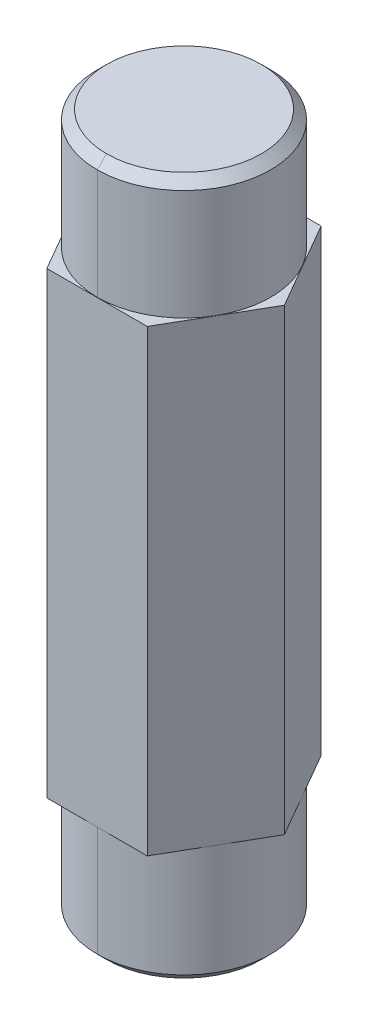
ISO-10303-21;
HEADER;
FILE_DESCRIPTION(('STEP AP214'),'2;1');
FILE_NAME('part.step','',(''),(''),'','','');
FILE_SCHEMA(('AUTOMOTIVE_DESIGN { 1 0 10303 214 1 1 1 1 }'));
ENDSEC;
DATA;
#1=APPLICATION_CONTEXT('core data for automotive mechanical design processes');
#2=APPLICATION_PROTOCOL_DEFINITION('international standard','automotive_design',2000,#1);
#3=PRODUCT_CONTEXT('',#1,'mechanical');
#4=PRODUCT('Part','Part','',(#3));
#5=PRODUCT_RELATED_PRODUCT_CATEGORY('part','',(#4));
#6=PRODUCT_DEFINITION_FORMATION('','',#4);
#7=PRODUCT_DEFINITION_CONTEXT('part definition',#1,'design');
#8=PRODUCT_DEFINITION('design','',#6,#7);
#9=PRODUCT_DEFINITION_SHAPE('','',#8);
#10=(LENGTH_UNIT() NAMED_UNIT(*) SI_UNIT(.MILLI.,.METRE.));
#11=(NAMED_UNIT(*) PLANE_ANGLE_UNIT() SI_UNIT($,.RADIAN.));
#12=(NAMED_UNIT(*) SI_UNIT($,.STERADIAN.) SOLID_ANGLE_UNIT());
#13=UNCERTAINTY_MEASURE_WITH_UNIT(LENGTH_MEASURE(1.E-05),#10,'distance_accuracy_value','');
#14=(GEOMETRIC_REPRESENTATION_CONTEXT(3) GLOBAL_UNCERTAINTY_ASSIGNED_CONTEXT((#13)) GLOBAL_UNIT_ASSIGNED_CONTEXT((#10,
#11,#12)) REPRESENTATION_CONTEXT('',''));
#15=CARTESIAN_POINT('',(0.,0.,0.));
#16=DIRECTION('',(0.,0.,1.));
#17=DIRECTION('',(1.,0.,0.));
#18=AXIS2_PLACEMENT_3D('',#15,#16,#17);
#19=CARTESIAN_POINT('',(-39.2241243202131,6.35,-16.6661167863654));
#20=DIRECTION('',(0.,-1.,0.));
#21=DIRECTION('',(0.,0.,-1.));
#22=AXIS2_PLACEMENT_3D('',#19,#20,#21);
#23=CYLINDRICAL_SURFACE('',#22,4.7498);
#24=DIRECTION('',(0.,-1.,0.));
#25=VECTOR('',#24,1.);
#26=CARTESIAN_POINT('',(-39.2241243202131,6.35,-11.9163167863655));
#27=LINE('',#26,#25);
#28=CARTESIAN_POINT('',(-39.2241243202131,5.842,-11.9163167863655));
#29=VERTEX_POINT('',#28);
#30=CARTESIAN_POINT('',(-39.2241243202131,-0.2032,-11.9163167863655));
#31=VERTEX_POINT('',#30);
#32=EDGE_CURVE('E296',#29,#31,#27,.T.);
#33=ORIENTED_EDGE('',*,*,#32,.F.);
#34=CARTESIAN_POINT('',(-39.2241243202131,5.842,-16.6661167863654));
#35=DIRECTION('',(0.,-1.,0.));
#36=DIRECTION('',(0.,0.,-1.));
#37=AXIS2_PLACEMENT_3D('',#34,#35,#36);
#38=CIRCLE('',#37,4.7498);
#39=CARTESIAN_POINT('',(-39.2241243202131,5.842,-21.4159167863655));
#40=VERTEX_POINT('',#39);
#41=EDGE_CURVE('E11',#29,#40,#38,.T.);
#42=ORIENTED_EDGE('',*,*,#41,.T.);
#43=DIRECTION('',(0.,-1.,0.));
#44=VECTOR('',#43,1.);
#45=CARTESIAN_POINT('',(-39.2241243202131,6.35,-21.4159167863655));
#46=LINE('',#45,#44);
#47=CARTESIAN_POINT('',(-39.2241243202131,-0.2032,-21.4159167863655));
#48=VERTEX_POINT('',#47);
#49=EDGE_CURVE('E192',#40,#48,#46,.T.);
#50=ORIENTED_EDGE('',*,*,#49,.T.);
#51=CARTESIAN_POINT('',(-39.2241243202131,-0.2032,-16.6661167863654));
#52=DIRECTION('',(0.,1.,0.));
#53=DIRECTION('',(0.,0.,1.));
#54=AXIS2_PLACEMENT_3D('',#51,#52,#53);
#55=CIRCLE('',#54,4.7498);
#56=EDGE_CURVE('E147',#48,#31,#55,.T.);
#57=ORIENTED_EDGE('',*,*,#56,.T.);
#58=EDGE_LOOP('',(#33,#42,#50,#57));
#59=FACE_BOUND('',#58,.T.);
#60=ADVANCED_FACE('F16',(#59),#23,.T.);
#61=CARTESIAN_POINT('',(-39.2241243202131,5.842,-16.6661167863654));
#62=DIRECTION('',(0.,-1.,0.));
#63=DIRECTION('',(0.,0.,-1.));
#64=AXIS2_PLACEMENT_3D('',#61,#62,#63);
#65=CONICAL_SURFACE('',#64,4.7498,0.785398163397452);
#66=DIRECTION('',(0.,-0.707106781186545,0.70710678118655));
#67=VECTOR('',#66,1.);
#68=CARTESIAN_POINT('',(-39.2241243202131,5.842,-11.9163167863655));
#69=LINE('',#68,#67);
#70=CARTESIAN_POINT('',(-39.2241243202131,6.35,-12.4243167863655));
#71=VERTEX_POINT('',#70);
#72=EDGE_CURVE('E181',#71,#29,#69,.T.);
#73=ORIENTED_EDGE('',*,*,#72,.F.);
#74=CARTESIAN_POINT('',(-39.2241243202131,6.35,-16.6661167863654));
#75=DIRECTION('',(0.,1.,0.));
#76=DIRECTION('',(0.,0.,-1.));
#77=AXIS2_PLACEMENT_3D('',#74,#75,#76);
#78=CIRCLE('',#77,4.2418);
#79=CARTESIAN_POINT('',(-39.2241243202131,6.35,-20.9079167863655));
#80=VERTEX_POINT('',#79);
#81=EDGE_CURVE('E24',#80,#71,#78,.T.);
#82=ORIENTED_EDGE('',*,*,#81,.F.);
#83=DIRECTION('',(0.,-0.707106781186545,-0.70710678118655));
#84=VECTOR('',#83,1.);
#85=CARTESIAN_POINT('',(-39.2241243202131,5.842,-21.4159167863655));
#86=LINE('',#85,#84);
#87=EDGE_CURVE('E175',#80,#40,#86,.T.);
#88=ORIENTED_EDGE('',*,*,#87,.T.);
#89=ORIENTED_EDGE('',*,*,#41,.F.);
#90=EDGE_LOOP('',(#73,#82,#88,#89));
#91=FACE_BOUND('',#90,.T.);
#92=ADVANCED_FACE('F274',(#91),#65,.T.);
#93=CARTESIAN_POINT('',(-39.2241243202131,6.35,-16.6661167863654));
#94=DIRECTION('',(0.,-1.,0.));
#95=DIRECTION('',(0.,0.,-1.));
#96=AXIS2_PLACEMENT_3D('',#93,#94,#95);
#97=PLANE('',#96);
#98=ORIENTED_EDGE('',*,*,#81,.T.);
#99=CARTESIAN_POINT('',(-39.2241243202131,6.35,-16.6661167863654));
#100=DIRECTION('',(0.,1.,0.));
#101=DIRECTION('',(0.,0.,-1.));
#102=AXIS2_PLACEMENT_3D('',#99,#100,#101);
#103=CIRCLE('',#102,4.2418);
#104=EDGE_CURVE('E190',#71,#80,#103,.T.);
#105=ORIENTED_EDGE('',*,*,#104,.T.);
#106=EDGE_LOOP('',(#98,#105));
#107=FACE_BOUND('',#106,.T.);
#108=ADVANCED_FACE('F271',(#107),#97,.F.);
#109=CARTESIAN_POINT('',(-44.7233856342443,-0.2032,-16.6661167863654));
#110=DIRECTION('',(0.,1.,0.));
#111=DIRECTION('',(1.,0.,0.));
#112=AXIS2_PLACEMENT_3D('',#109,#110,#111);
#113=PLANE('',#112);
#114=ORIENTED_EDGE('',*,*,#56,.F.);
#115=CARTESIAN_POINT('',(-39.2241243202131,-0.2032,-16.6661167863654));
#116=DIRECTION('',(0.,1.,0.));
#117=DIRECTION('',(0.,0.,1.));
#118=AXIS2_PLACEMENT_3D('',#115,#116,#117);
#119=CIRCLE('',#118,4.7498);
#120=EDGE_CURVE('E286',#31,#48,#119,.T.);
#121=ORIENTED_EDGE('',*,*,#120,.F.);
#122=EDGE_LOOP('',(#114,#121));
#123=FACE_BOUND('',#122,.T.);
#124=DIRECTION('',(-0.5,0.,0.866025403784438));
#125=VECTOR('',#124,1.);
#126=CARTESIAN_POINT('',(-41.9737549772286,-0.2032,-21.4286167863654));
#127=LINE('',#126,#125);
#128=CARTESIAN_POINT('',(-41.9737549772286,-0.2032,-21.4286167863654));
#129=VERTEX_POINT('',#128);
#130=CARTESIAN_POINT('',(-44.7233856342443,-0.2032,-16.6661167863654));
#131=VERTEX_POINT('',#130);
#132=EDGE_CURVE('E40',#129,#131,#127,.T.);
#133=ORIENTED_EDGE('',*,*,#132,.T.);
#134=DIRECTION('',(0.5,0.,0.866025403784439));
#135=VECTOR('',#134,1.);
#136=CARTESIAN_POINT('',(-44.7233856342443,-0.2032,-16.6661167863654));
#137=LINE('',#136,#135);
#138=CARTESIAN_POINT('',(-41.9737549772286,-0.2032,-11.9036167863655));
#139=VERTEX_POINT('',#138);
#140=EDGE_CURVE('E214',#131,#139,#137,.T.);
#141=ORIENTED_EDGE('',*,*,#140,.T.);
#142=DIRECTION('',(1.,0.,0.));
#143=VECTOR('',#142,1.);
#144=CARTESIAN_POINT('',(-41.9737549772286,-0.2032,-11.9036167863655));
#145=LINE('',#144,#143);
#146=CARTESIAN_POINT('',(-36.4744936631975,-0.2032,-11.9036167863655));
#147=VERTEX_POINT('',#146);
#148=EDGE_CURVE('E226',#139,#147,#145,.T.);
#149=ORIENTED_EDGE('',*,*,#148,.T.);
#150=DIRECTION('',(0.5,0.,-0.866025403784438));
#151=VECTOR('',#150,1.);
#152=CARTESIAN_POINT('',(-36.4744936631975,-0.2032,-11.9036167863655));
#153=LINE('',#152,#151);
#154=CARTESIAN_POINT('',(-33.7248630061819,-0.2032,-16.6661167863654));
#155=VERTEX_POINT('',#154);
#156=EDGE_CURVE('E241',#147,#155,#153,.T.);
#157=ORIENTED_EDGE('',*,*,#156,.T.);
#158=DIRECTION('',(-0.5,0.,-0.866025403784439));
#159=VECTOR('',#158,1.);
#160=CARTESIAN_POINT('',(-33.7248630061819,-0.2032,-16.6661167863654));
#161=LINE('',#160,#159);
#162=CARTESIAN_POINT('',(-36.4744936631975,-0.2032,-21.4286167863654));
#163=VERTEX_POINT('',#162);
#164=EDGE_CURVE('E208',#155,#163,#161,.T.);
#165=ORIENTED_EDGE('',*,*,#164,.T.);
#166=DIRECTION('',(-1.,0.,0.));
#167=VECTOR('',#166,1.);
#168=CARTESIAN_POINT('',(-36.4744936631975,-0.2032,-21.4286167863654));
#169=LINE('',#168,#167);
#170=EDGE_CURVE('E251',#163,#129,#169,.T.);
#171=ORIENTED_EDGE('',*,*,#170,.T.);
#172=EDGE_LOOP('',(#133,#141,#149,#157,#165,#171));
#173=FACE_BOUND('',#172,.T.);
#174=ADVANCED_FACE('F568',(#123,#173),#113,.T.);
#175=CARTESIAN_POINT('',(-39.2241243202131,-31.877,-16.6661167863654));
#176=DIRECTION('',(0.,1.,0.));
#177=DIRECTION('',(0.,0.,1.));
#178=AXIS2_PLACEMENT_3D('',#175,#176,#177);
#179=CYLINDRICAL_SURFACE('',#178,4.7498);
#180=DIRECTION('',(0.,1.,0.));
#181=VECTOR('',#180,1.);
#182=CARTESIAN_POINT('',(-39.2241243202131,-31.877,-21.4159167863655));
#183=LINE('',#182,#181);
#184=CARTESIAN_POINT('',(-39.2241243202131,-31.369,-21.4159167863655));
#185=VERTEX_POINT('',#184);
#186=CARTESIAN_POINT('',(-39.2241243202131,-25.3238,-21.4159167863655));
#187=VERTEX_POINT('',#186);
#188=EDGE_CURVE('E162',#185,#187,#183,.T.);
#189=ORIENTED_EDGE('',*,*,#188,.F.);
#190=CARTESIAN_POINT('',(-39.2241243202131,-31.369,-16.6661167863654));
#191=DIRECTION('',(0.,1.,0.));
#192=DIRECTION('',(0.,0.,1.));
#193=AXIS2_PLACEMENT_3D('',#190,#191,#192);
#194=CIRCLE('',#193,4.7498);
#195=CARTESIAN_POINT('',(-39.2241243202131,-31.369,-11.9163167863655));
#196=VERTEX_POINT('',#195);
#197=EDGE_CURVE('E139',#185,#196,#194,.T.);
#198=ORIENTED_EDGE('',*,*,#197,.T.);
#199=DIRECTION('',(0.,1.,0.));
#200=VECTOR('',#199,1.);
#201=CARTESIAN_POINT('',(-39.2241243202131,-31.877,-11.9163167863655));
#202=LINE('',#201,#200);
#203=CARTESIAN_POINT('',(-39.2241243202131,-25.3238,-11.9163167863655));
#204=VERTEX_POINT('',#203);
#205=EDGE_CURVE('E174',#196,#204,#202,.T.);
#206=ORIENTED_EDGE('',*,*,#205,.T.);
#207=CARTESIAN_POINT('',(-39.2241243202131,-25.3238,-16.6661167863654));
#208=DIRECTION('',(0.,-1.,0.));
#209=DIRECTION('',(0.,0.,-1.));
#210=AXIS2_PLACEMENT_3D('',#207,#208,#209);
#211=CIRCLE('',#210,4.7498);
#212=EDGE_CURVE('E164',#204,#187,#211,.T.);
#213=ORIENTED_EDGE('',*,*,#212,.T.);
#214=EDGE_LOOP('',(#189,#198,#206,#213));
#215=FACE_BOUND('',#214,.T.);
#216=ADVANCED_FACE('F163',(#215),#179,.T.);
#217=CARTESIAN_POINT('',(-39.2241243202131,-31.369,-16.6661167863654));
#218=DIRECTION('',(0.,1.,0.));
#219=DIRECTION('',(0.,0.,1.));
#220=AXIS2_PLACEMENT_3D('',#217,#218,#219);
#221=CONICAL_SURFACE('',#220,4.7498,0.78539816339745);
#222=DIRECTION('',(0.,0.707106781186546,-0.707106781186549));
#223=VECTOR('',#222,1.);
#224=CARTESIAN_POINT('',(-39.2241243202131,-31.369,-21.4159167863655));
#225=LINE('',#224,#223);
#226=CARTESIAN_POINT('',(-39.2241243202131,-31.877,-20.9079167863655));
#227=VERTEX_POINT('',#226);
#228=EDGE_CURVE('E143',#227,#185,#225,.T.);
#229=ORIENTED_EDGE('',*,*,#228,.F.);
#230=CARTESIAN_POINT('',(-39.2241243202131,-31.877,-16.6661167863654));
#231=DIRECTION('',(0.,-1.,0.));
#232=DIRECTION('',(0.,0.,1.));
#233=AXIS2_PLACEMENT_3D('',#230,#231,#232);
#234=CIRCLE('',#233,4.2418);
#235=CARTESIAN_POINT('',(-39.2241243202131,-31.877,-12.4243167863655));
#236=VERTEX_POINT('',#235);
#237=EDGE_CURVE('E151',#236,#227,#234,.T.);
#238=ORIENTED_EDGE('',*,*,#237,.F.);
#239=DIRECTION('',(0.,0.707106781186546,0.707106781186549));
#240=VECTOR('',#239,1.);
#241=CARTESIAN_POINT('',(-39.2241243202131,-31.369,-11.9163167863655));
#242=LINE('',#241,#240);
#243=EDGE_CURVE('E145',#236,#196,#242,.T.);
#244=ORIENTED_EDGE('',*,*,#243,.T.);
#245=ORIENTED_EDGE('',*,*,#197,.F.);
#246=EDGE_LOOP('',(#229,#238,#244,#245));
#247=FACE_BOUND('',#246,.T.);
#248=ADVANCED_FACE('F138',(#247),#221,.T.);
#249=CARTESIAN_POINT('',(-39.2241243202131,-31.877,-16.6661167863654));
#250=DIRECTION('',(0.,1.,0.));
#251=DIRECTION('',(1.,0.,0.));
#252=AXIS2_PLACEMENT_3D('',#249,#250,#251);
#253=PLANE('',#252);
#254=ORIENTED_EDGE('',*,*,#237,.T.);
#255=CARTESIAN_POINT('',(-39.2241243202131,-31.877,-16.6661167863654));
#256=DIRECTION('',(0.,-1.,0.));
#257=DIRECTION('',(0.,0.,1.));
#258=AXIS2_PLACEMENT_3D('',#255,#256,#257);
#259=CIRCLE('',#258,4.2418);
#260=EDGE_CURVE('E157',#227,#236,#259,.T.);
#261=ORIENTED_EDGE('',*,*,#260,.T.);
#262=EDGE_LOOP('',(#254,#261));
#263=FACE_BOUND('',#262,.T.);
#264=ADVANCED_FACE('F610',(#263),#253,.F.);
#265=CARTESIAN_POINT('',(-41.9737549772286,-25.3238,-11.9036167863655));
#266=DIRECTION('',(0.,-1.,0.));
#267=DIRECTION('',(0.,0.,-1.));
#268=AXIS2_PLACEMENT_3D('',#265,#266,#267);
#269=PLANE('',#268);
#270=ORIENTED_EDGE('',*,*,#212,.F.);
#271=CARTESIAN_POINT('',(-39.2241243202131,-25.3238,-16.6661167863654));
#272=DIRECTION('',(0.,-1.,0.));
#273=DIRECTION('',(0.,0.,-1.));
#274=AXIS2_PLACEMENT_3D('',#271,#272,#273);
#275=CIRCLE('',#274,4.7498);
#276=EDGE_CURVE('E168',#187,#204,#275,.T.);
#277=ORIENTED_EDGE('',*,*,#276,.F.);
#278=EDGE_LOOP('',(#270,#277));
#279=FACE_BOUND('',#278,.T.);
#280=DIRECTION('',(-1.,0.,0.));
#281=VECTOR('',#280,1.);
#282=CARTESIAN_POINT('',(-36.4744936631975,-25.3238,-11.9036167863655));
#283=LINE('',#282,#281);
#284=CARTESIAN_POINT('',(-36.4744936631975,-25.3238,-11.9036167863655));
#285=VERTEX_POINT('',#284);
#286=CARTESIAN_POINT('',(-41.9737549772286,-25.3238,-11.9036167863655));
#287=VERTEX_POINT('',#286);
#288=EDGE_CURVE('E231',#285,#287,#283,.T.);
#289=ORIENTED_EDGE('',*,*,#288,.T.);
#290=DIRECTION('',(-0.5,0.,-0.866025403784439));
#291=VECTOR('',#290,1.);
#292=CARTESIAN_POINT('',(-41.9737549772286,-25.3238,-11.9036167863655));
#293=LINE('',#292,#291);
#294=CARTESIAN_POINT('',(-44.7233856342443,-25.3238,-16.6661167863654));
#295=VERTEX_POINT('',#294);
#296=EDGE_CURVE('E218',#287,#295,#293,.T.);
#297=ORIENTED_EDGE('',*,*,#296,.T.);
#298=DIRECTION('',(0.5,0.,-0.866025403784438));
#299=VECTOR('',#298,1.);
#300=CARTESIAN_POINT('',(-44.7233856342443,-25.3238,-16.6661167863654));
#301=LINE('',#300,#299);
#302=CARTESIAN_POINT('',(-41.9737549772286,-25.3238,-21.4286167863654));
#303=VERTEX_POINT('',#302);
#304=EDGE_CURVE('E48',#295,#303,#301,.T.);
#305=ORIENTED_EDGE('',*,*,#304,.T.);
#306=DIRECTION('',(1.,0.,0.));
#307=VECTOR('',#306,1.);
#308=CARTESIAN_POINT('',(-41.9737549772286,-25.3238,-21.4286167863654));
#309=LINE('',#308,#307);
#310=CARTESIAN_POINT('',(-36.4744936631975,-25.3238,-21.4286167863654));
#311=VERTEX_POINT('',#310);
#312=EDGE_CURVE('E258',#303,#311,#309,.T.);
#313=ORIENTED_EDGE('',*,*,#312,.T.);
#314=DIRECTION('',(0.5,0.,0.866025403784439));
#315=VECTOR('',#314,1.);
#316=CARTESIAN_POINT('',(-36.4744936631975,-25.3238,-21.4286167863654));
#317=LINE('',#316,#315);
#318=CARTESIAN_POINT('',(-33.7248630061819,-25.3238,-16.6661167863654));
#319=VERTEX_POINT('',#318);
#320=EDGE_CURVE('E230',#311,#319,#317,.T.);
#321=ORIENTED_EDGE('',*,*,#320,.T.);
#322=DIRECTION('',(-0.5,0.,0.866025403784438));
#323=VECTOR('',#322,1.);
#324=CARTESIAN_POINT('',(-33.7248630061819,-25.3238,-16.6661167863654));
#325=LINE('',#324,#323);
#326=EDGE_CURVE('E207',#319,#285,#325,.T.);
#327=ORIENTED_EDGE('',*,*,#326,.T.);
#328=EDGE_LOOP('',(#289,#297,#305,#313,#321,#327));
#329=FACE_BOUND('',#328,.T.);
#330=ADVANCED_FACE('F600',(#279,#329),#269,.T.);
#331=CARTESIAN_POINT('',(-41.9737549772286,-25.527,-21.4286167863654));
#332=DIRECTION('',(-0.866025403784438,0.,-0.5));
#333=DIRECTION('',(-0.5,0.,0.866025403784438));
#334=AXIS2_PLACEMENT_3D('',#331,#332,#333);
#335=PLANE('',#334);
#336=DIRECTION('',(0.,1.,0.));
#337=VECTOR('',#336,1.);
#338=CARTESIAN_POINT('',(-44.7233856342443,-25.527,-16.6661167863654));
#339=LINE('',#338,#337);
#340=EDGE_CURVE('E186',#295,#131,#339,.T.);
#341=ORIENTED_EDGE('',*,*,#340,.T.);
#342=ORIENTED_EDGE('',*,*,#132,.F.);
#343=DIRECTION('',(0.,1.,0.));
#344=VECTOR('',#343,1.);
#345=CARTESIAN_POINT('',(-41.9737549772286,-25.527,-21.4286167863654));
#346=LINE('',#345,#344);
#347=EDGE_CURVE('E246',#303,#129,#346,.T.);
#348=ORIENTED_EDGE('',*,*,#347,.F.);
#349=ORIENTED_EDGE('',*,*,#304,.F.);
#350=EDGE_LOOP('',(#341,#342,#348,#349));
#351=FACE_BOUND('',#350,.T.);
#352=ADVANCED_FACE('F553',(#351),#335,.T.);
#353=CARTESIAN_POINT('',(-36.4744936631975,-25.527,-21.4286167863654));
#354=DIRECTION('',(0.,0.,-1.));
#355=DIRECTION('',(0.,-1.,0.));
#356=AXIS2_PLACEMENT_3D('',#353,#354,#355);
#357=PLANE('',#356);
#358=ORIENTED_EDGE('',*,*,#347,.T.);
#359=ORIENTED_EDGE('',*,*,#170,.F.);
#360=DIRECTION('',(0.,1.,0.));
#361=VECTOR('',#360,1.);
#362=CARTESIAN_POINT('',(-36.4744936631975,-25.527,-21.4286167863654));
#363=LINE('',#362,#361);
#364=EDGE_CURVE('E204',#311,#163,#363,.T.);
#365=ORIENTED_EDGE('',*,*,#364,.F.);
#366=ORIENTED_EDGE('',*,*,#312,.F.);
#367=EDGE_LOOP('',(#358,#359,#365,#366));
#368=FACE_BOUND('',#367,.T.);
#369=ADVANCED_FACE('F548',(#368),#357,.T.);
#370=CARTESIAN_POINT('',(-33.7248630061819,-25.527,-16.6661167863654));
#371=DIRECTION('',(0.866025403784439,0.,-0.5));
#372=DIRECTION('',(0.,-1.,0.));
#373=AXIS2_PLACEMENT_3D('',#370,#371,#372);
#374=PLANE('',#373);
#375=ORIENTED_EDGE('',*,*,#364,.T.);
#376=ORIENTED_EDGE('',*,*,#164,.F.);
#377=DIRECTION('',(0.,1.,0.));
#378=VECTOR('',#377,1.);
#379=CARTESIAN_POINT('',(-33.7248630061819,-25.527,-16.6661167863654));
#380=LINE('',#379,#378);
#381=EDGE_CURVE('E236',#319,#155,#380,.T.);
#382=ORIENTED_EDGE('',*,*,#381,.F.);
#383=ORIENTED_EDGE('',*,*,#320,.F.);
#384=EDGE_LOOP('',(#375,#376,#382,#383));
#385=FACE_BOUND('',#384,.T.);
#386=ADVANCED_FACE('F551',(#385),#374,.T.);
#387=CARTESIAN_POINT('',(-36.4744936631975,-25.527,-11.9036167863655));
#388=DIRECTION('',(0.866025403784438,0.,0.5));
#389=DIRECTION('',(0.,-1.,0.));
#390=AXIS2_PLACEMENT_3D('',#387,#388,#389);
#391=PLANE('',#390);
#392=ORIENTED_EDGE('',*,*,#381,.T.);
#393=ORIENTED_EDGE('',*,*,#156,.F.);
#394=DIRECTION('',(0.,1.,0.));
#395=VECTOR('',#394,1.);
#396=CARTESIAN_POINT('',(-36.4744936631975,-25.527,-11.9036167863655));
#397=LINE('',#396,#395);
#398=EDGE_CURVE('E225',#285,#147,#397,.T.);
#399=ORIENTED_EDGE('',*,*,#398,.F.);
#400=ORIENTED_EDGE('',*,*,#326,.F.);
#401=EDGE_LOOP('',(#392,#393,#399,#400));
#402=FACE_BOUND('',#401,.T.);
#403=ADVANCED_FACE('F541',(#402),#391,.T.);
#404=CARTESIAN_POINT('',(-41.9737549772286,-25.527,-11.9036167863655));
#405=DIRECTION('',(0.,0.,1.));
#406=DIRECTION('',(1.,0.,0.));
#407=AXIS2_PLACEMENT_3D('',#404,#405,#406);
#408=PLANE('',#407);
#409=ORIENTED_EDGE('',*,*,#398,.T.);
#410=ORIENTED_EDGE('',*,*,#148,.F.);
#411=DIRECTION('',(0.,1.,0.));
#412=VECTOR('',#411,1.);
#413=CARTESIAN_POINT('',(-41.9737549772286,-25.527,-11.9036167863655));
#414=LINE('',#413,#412);
#415=EDGE_CURVE('E201',#287,#139,#414,.T.);
#416=ORIENTED_EDGE('',*,*,#415,.F.);
#417=ORIENTED_EDGE('',*,*,#288,.F.);
#418=EDGE_LOOP('',(#409,#410,#416,#417));
#419=FACE_BOUND('',#418,.T.);
#420=ADVANCED_FACE('F529',(#419),#408,.T.);
#421=CARTESIAN_POINT('',(-44.7233856342443,-25.527,-16.6661167863654));
#422=DIRECTION('',(-0.866025403784439,0.,0.5));
#423=DIRECTION('',(0.,1.,0.));
#424=AXIS2_PLACEMENT_3D('',#421,#422,#423);
#425=PLANE('',#424);
#426=ORIENTED_EDGE('',*,*,#415,.T.);
#427=ORIENTED_EDGE('',*,*,#140,.F.);
#428=ORIENTED_EDGE('',*,*,#340,.F.);
#429=ORIENTED_EDGE('',*,*,#296,.F.);
#430=EDGE_LOOP('',(#426,#427,#428,#429));
#431=FACE_BOUND('',#430,.T.);
#432=ADVANCED_FACE('F519',(#431),#425,.T.);
#433=CARTESIAN_POINT('',(-39.2241243202131,-31.369,-16.6661167863654));
#434=DIRECTION('',(0.,1.,0.));
#435=DIRECTION('',(0.,0.,1.));
#436=AXIS2_PLACEMENT_3D('',#433,#434,#435);
#437=CONICAL_SURFACE('',#436,4.7498,0.78539816339745);
#438=ORIENTED_EDGE('',*,*,#260,.F.);
#439=ORIENTED_EDGE('',*,*,#228,.T.);
#440=CARTESIAN_POINT('',(-39.2241243202131,-31.369,-16.6661167863654));
#441=DIRECTION('',(0.,1.,0.));
#442=DIRECTION('',(0.,0.,1.));
#443=AXIS2_PLACEMENT_3D('',#440,#441,#442);
#444=CIRCLE('',#443,4.7498);
#445=EDGE_CURVE('E160',#196,#185,#444,.T.);
#446=ORIENTED_EDGE('',*,*,#445,.F.);
#447=ORIENTED_EDGE('',*,*,#243,.F.);
#448=EDGE_LOOP('',(#438,#439,#446,#447));
#449=FACE_BOUND('',#448,.T.);
#450=ADVANCED_FACE('F154',(#449),#437,.T.);
#451=CARTESIAN_POINT('',(-39.2241243202131,-31.877,-16.6661167863654));
#452=DIRECTION('',(0.,1.,0.));
#453=DIRECTION('',(0.,0.,1.));
#454=AXIS2_PLACEMENT_3D('',#451,#452,#453);
#455=CYLINDRICAL_SURFACE('',#454,4.7498);
#456=ORIENTED_EDGE('',*,*,#445,.T.);
#457=ORIENTED_EDGE('',*,*,#188,.T.);
#458=ORIENTED_EDGE('',*,*,#276,.T.);
#459=ORIENTED_EDGE('',*,*,#205,.F.);
#460=EDGE_LOOP('',(#456,#457,#458,#459));
#461=FACE_BOUND('',#460,.T.);
#462=ADVANCED_FACE('F172',(#461),#455,.T.);
#463=CARTESIAN_POINT('',(-39.2241243202131,5.842,-16.6661167863654));
#464=DIRECTION('',(0.,-1.,0.));
#465=DIRECTION('',(0.,0.,-1.));
#466=AXIS2_PLACEMENT_3D('',#463,#464,#465);
#467=CONICAL_SURFACE('',#466,4.7498,0.785398163397452);
#468=ORIENTED_EDGE('',*,*,#104,.F.);
#469=ORIENTED_EDGE('',*,*,#72,.T.);
#470=CARTESIAN_POINT('',(-39.2241243202131,5.842,-16.6661167863654));
#471=DIRECTION('',(0.,-1.,0.));
#472=DIRECTION('',(0.,0.,-1.));
#473=AXIS2_PLACEMENT_3D('',#470,#471,#472);
#474=CIRCLE('',#473,4.7498);
#475=EDGE_CURVE('E281',#40,#29,#474,.T.);
#476=ORIENTED_EDGE('',*,*,#475,.F.);
#477=ORIENTED_EDGE('',*,*,#87,.F.);
#478=EDGE_LOOP('',(#468,#469,#476,#477));
#479=FACE_BOUND('',#478,.T.);
#480=ADVANCED_FACE('F276',(#479),#467,.T.);
#481=CARTESIAN_POINT('',(-39.2241243202131,6.35,-16.6661167863654));
#482=DIRECTION('',(0.,-1.,0.));
#483=DIRECTION('',(0.,0.,-1.));
#484=AXIS2_PLACEMENT_3D('',#481,#482,#483);
#485=CYLINDRICAL_SURFACE('',#484,4.7498);
#486=ORIENTED_EDGE('',*,*,#475,.T.);
#487=ORIENTED_EDGE('',*,*,#32,.T.);
#488=ORIENTED_EDGE('',*,*,#120,.T.);
#489=ORIENTED_EDGE('',*,*,#49,.F.);
#490=EDGE_LOOP('',(#486,#487,#488,#489));
#491=FACE_BOUND('',#490,.T.);
#492=ADVANCED_FACE('F287',(#491),#485,.T.);
#493=CLOSED_SHELL('',(#60,#92,#108,#174,#216,#248,#264,#330,#352,#369,#386,#403,#420,#432,#450,
#462,#480,#492));
#494=MANIFOLD_SOLID_BREP('B1',#493);
#495=ADVANCED_BREP_SHAPE_REPRESENTATION('',(#18,#494),#14);
#496=SHAPE_DEFINITION_REPRESENTATION(#9,#495);
ENDSEC;
END-ISO-10303-21;
